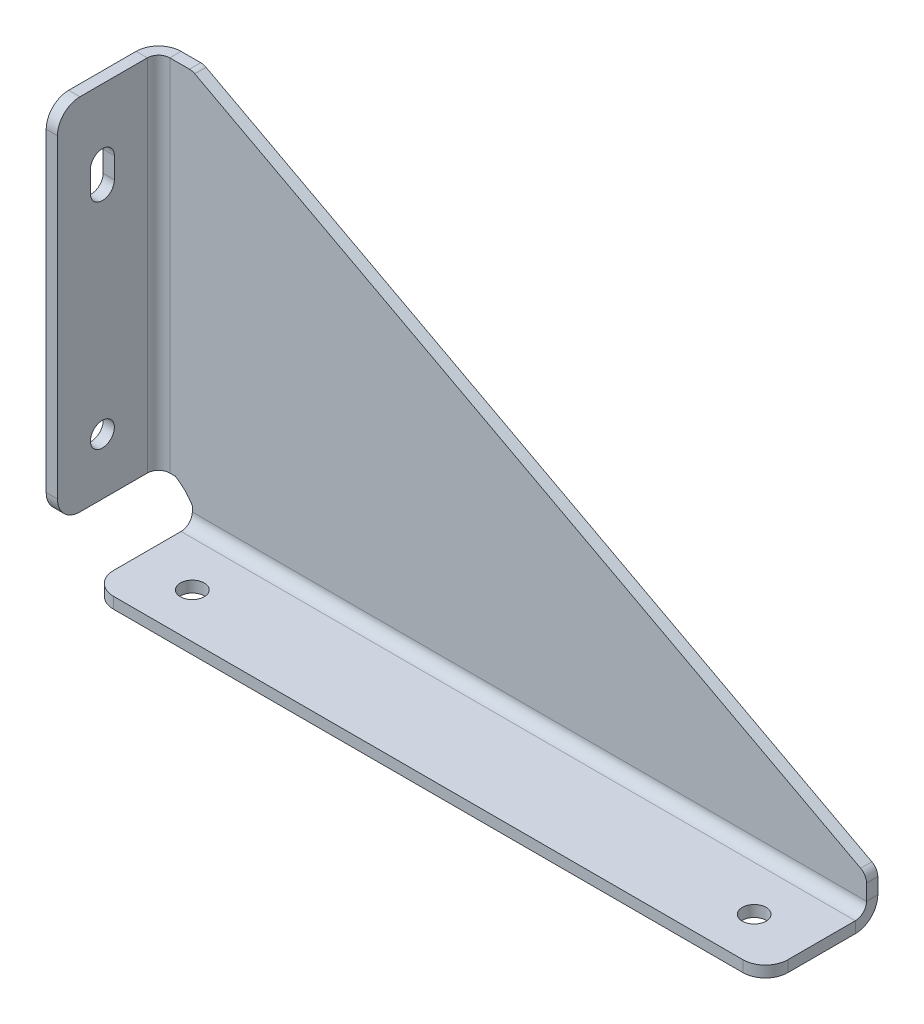
ISO-10303-21;
HEADER;
FILE_DESCRIPTION(('STEP AP214'),'2;1');
FILE_NAME('part.step','',(''),(''),'','','');
FILE_SCHEMA(('AUTOMOTIVE_DESIGN { 1 0 10303 214 1 1 1 1 }'));
ENDSEC;
DATA;
#1=APPLICATION_CONTEXT('core data for automotive mechanical design processes');
#2=APPLICATION_PROTOCOL_DEFINITION('international standard','automotive_design',2000,#1);
#3=PRODUCT_CONTEXT('',#1,'mechanical');
#4=PRODUCT('Part','Part','',(#3));
#5=PRODUCT_RELATED_PRODUCT_CATEGORY('part','',(#4));
#6=PRODUCT_DEFINITION_FORMATION('','',#4);
#7=PRODUCT_DEFINITION_CONTEXT('part definition',#1,'design');
#8=PRODUCT_DEFINITION('design','',#6,#7);
#9=PRODUCT_DEFINITION_SHAPE('','',#8);
#10=(LENGTH_UNIT() NAMED_UNIT(*) SI_UNIT(.MILLI.,.METRE.));
#11=(NAMED_UNIT(*) PLANE_ANGLE_UNIT() SI_UNIT($,.RADIAN.));
#12=(NAMED_UNIT(*) SI_UNIT($,.STERADIAN.) SOLID_ANGLE_UNIT());
#13=UNCERTAINTY_MEASURE_WITH_UNIT(LENGTH_MEASURE(1.E-05),#10,'distance_accuracy_value','');
#14=(GEOMETRIC_REPRESENTATION_CONTEXT(3) GLOBAL_UNCERTAINTY_ASSIGNED_CONTEXT((#13)) GLOBAL_UNIT_ASSIGNED_CONTEXT((#10,
#11,#12)) REPRESENTATION_CONTEXT('',''));
#15=CARTESIAN_POINT('',(0.,0.,0.));
#16=DIRECTION('',(0.,0.,1.));
#17=DIRECTION('',(1.,0.,0.));
#18=AXIS2_PLACEMENT_3D('',#15,#16,#17);
#19=CARTESIAN_POINT('',(3.175,0.,0.));
#20=DIRECTION('',(1.,0.,0.));
#21=DIRECTION('',(0.,0.,-1.));
#22=AXIS2_PLACEMENT_3D('',#19,#20,#21);
#23=PLANE('',#22);
#24=CARTESIAN_POINT('',(3.17499999999994,28.5749999999999,15.875));
#25=DIRECTION('',(1.,0.,0.));
#26=DIRECTION('',(0.,0.,-1.));
#27=AXIS2_PLACEMENT_3D('',#24,#25,#26);
#28=CIRCLE('',#27,3.3782);
#29=CARTESIAN_POINT('',(3.17499999999996,28.5749999999999,12.4968));
#30=VERTEX_POINT('',#29);
#31=EDGE_CURVE('E390',#30,#30,#28,.T.);
#32=ORIENTED_EDGE('',*,*,#31,.F.);
#33=EDGE_LOOP('',(#32));
#34=FACE_BOUND('',#33,.T.);
#35=DIRECTION('',(0.,-1.,0.));
#36=VECTOR('',#35,1.);
#37=CARTESIAN_POINT('',(3.1749999999999,0.,28.575));
#38=LINE('',#37,#36);
#39=CARTESIAN_POINT('',(3.1749999999999,107.95,28.575));
#40=VERTEX_POINT('',#39);
#41=CARTESIAN_POINT('',(3.1749999999999,19.05,28.575));
#42=VERTEX_POINT('',#41);
#43=EDGE_CURVE('E421',#40,#42,#38,.T.);
#44=ORIENTED_EDGE('',*,*,#43,.T.);
#45=CARTESIAN_POINT('',(3.17499999999992,19.05,22.225));
#46=DIRECTION('',(1.,0.,0.));
#47=DIRECTION('',(0.,0.,-1.));
#48=AXIS2_PLACEMENT_3D('',#45,#46,#47);
#49=CIRCLE('',#48,6.35);
#50=CARTESIAN_POINT('',(3.17499999999992,12.7,22.225));
#51=VERTEX_POINT('',#50);
#52=EDGE_CURVE('E603',#42,#51,#49,.T.);
#53=ORIENTED_EDGE('',*,*,#52,.T.);
#54=DIRECTION('',(0.,0.,-1.));
#55=VECTOR('',#54,1.);
#56=CARTESIAN_POINT('',(3.175,12.7,0.));
#57=LINE('',#56,#55);
#58=CARTESIAN_POINT('',(3.17499999999997,12.7,3.17499999999999));
#59=VERTEX_POINT('',#58);
#60=EDGE_CURVE('E419',#51,#59,#57,.T.);
#61=ORIENTED_EDGE('',*,*,#60,.T.);
#62=DIRECTION('',(0.,-1.,0.));
#63=VECTOR('',#62,1.);
#64=CARTESIAN_POINT('',(3.17499999999999,114.3,3.17499999999999));
#65=LINE('',#64,#63);
#66=CARTESIAN_POINT('',(3.17499999999999,114.3,3.17499999999999));
#67=VERTEX_POINT('',#66);
#68=EDGE_CURVE('E434',#67,#59,#65,.T.);
#69=ORIENTED_EDGE('',*,*,#68,.F.);
#70=DIRECTION('',(0.,0.,1.));
#71=VECTOR('',#70,1.);
#72=CARTESIAN_POINT('',(3.175,114.3,0.));
#73=LINE('',#72,#71);
#74=CARTESIAN_POINT('',(3.17499999999992,114.3,22.225));
#75=VERTEX_POINT('',#74);
#76=EDGE_CURVE('E424',#67,#75,#73,.T.);
#77=ORIENTED_EDGE('',*,*,#76,.T.);
#78=CARTESIAN_POINT('',(3.17499999999992,107.95,22.225));
#79=DIRECTION('',(1.,0.,0.));
#80=DIRECTION('',(0.,0.,-1.));
#81=AXIS2_PLACEMENT_3D('',#78,#79,#80);
#82=CIRCLE('',#81,6.35);
#83=EDGE_CURVE('E601',#75,#40,#82,.T.);
#84=ORIENTED_EDGE('',*,*,#83,.T.);
#85=EDGE_LOOP('',(#44,#53,#61,#69,#77,#84));
#86=FACE_BOUND('',#85,.T.);
#87=CARTESIAN_POINT('',(3.17500000000006,89.1032,15.875));
#88=DIRECTION('',(1.,0.,0.));
#89=DIRECTION('',(0.,0.,-1.));
#90=AXIS2_PLACEMENT_3D('',#87,#88,#89);
#91=CIRCLE('',#90,3.3782);
#92=CARTESIAN_POINT('',(3.17500000000007,89.1032,19.2532));
#93=VERTEX_POINT('',#92);
#94=CARTESIAN_POINT('',(3.17500000000004,89.1032,12.4968));
#95=VERTEX_POINT('',#94);
#96=EDGE_CURVE('E367',#93,#95,#91,.T.);
#97=ORIENTED_EDGE('',*,*,#96,.F.);
#98=DIRECTION('',(0.,1.,0.));
#99=VECTOR('',#98,1.);
#100=CARTESIAN_POINT('',(3.17500000000007,89.1032,19.2532));
#101=LINE('',#100,#99);
#102=CARTESIAN_POINT('',(3.17500000000007,95.0467999999999,19.2532));
#103=VERTEX_POINT('',#102);
#104=EDGE_CURVE('E176',#93,#103,#101,.T.);
#105=ORIENTED_EDGE('',*,*,#104,.T.);
#106=CARTESIAN_POINT('',(3.17500000000006,95.0467999999999,15.875));
#107=DIRECTION('',(1.,0.,0.));
#108=DIRECTION('',(0.,0.,-1.));
#109=AXIS2_PLACEMENT_3D('',#106,#107,#108);
#110=CIRCLE('',#109,3.3782);
#111=CARTESIAN_POINT('',(3.17500000000004,95.0467999999999,12.4968));
#112=VERTEX_POINT('',#111);
#113=EDGE_CURVE('E360',#112,#103,#110,.T.);
#114=ORIENTED_EDGE('',*,*,#113,.F.);
#115=DIRECTION('',(0.,1.,0.));
#116=VECTOR('',#115,1.);
#117=CARTESIAN_POINT('',(3.17499999999996,0.,12.4968));
#118=LINE('',#117,#116);
#119=EDGE_CURVE('E612',#95,#112,#118,.T.);
#120=ORIENTED_EDGE('',*,*,#119,.F.);
#121=EDGE_LOOP('',(#97,#105,#114,#120));
#122=FACE_BOUND('',#121,.T.);
#123=ADVANCED_FACE('F160',(#34,#86,#122),#23,.T.);
#124=CARTESIAN_POINT('',(0.,0.,-3.175));
#125=DIRECTION('',(0.,0.,-1.));
#126=DIRECTION('',(-1.,0.,0.));
#127=AXIS2_PLACEMENT_3D('',#124,#125,#126);
#128=PLANE('',#127);
#129=DIRECTION('',(-1.,0.,0.));
#130=VECTOR('',#129,1.);
#131=CARTESIAN_POINT('',(0.,114.3,-3.175));
#132=LINE('',#131,#130);
#133=CARTESIAN_POINT('',(11.90625,114.3,-3.175));
#134=VERTEX_POINT('',#133);
#135=CARTESIAN_POINT('',(6.35,114.3,-3.175));
#136=VERTEX_POINT('',#135);
#137=EDGE_CURVE('E537',#134,#136,#132,.T.);
#138=ORIENTED_EDGE('',*,*,#137,.F.);
#139=CARTESIAN_POINT('',(11.90625,111.125,-3.175));
#140=DIRECTION('',(0.,0.,-1.));
#141=DIRECTION('',(-1.,0.,0.));
#142=AXIS2_PLACEMENT_3D('',#139,#140,#141);
#143=CIRCLE('',#142,3.175);
#144=CARTESIAN_POINT('',(13.4003676470588,113.926470588235,-3.175));
#145=VERTEX_POINT('',#144);
#146=EDGE_CURVE('E572',#134,#145,#143,.T.);
#147=ORIENTED_EDGE('',*,*,#146,.T.);
#148=DIRECTION('',(-0.88235294117647,0.470588235294118,0.));
#149=VECTOR('',#148,1.);
#150=CARTESIAN_POINT('',(12.7,114.3,-3.175));
#151=LINE('',#150,#149);
#152=CARTESIAN_POINT('',(201.519117647059,13.5964705882353,-3.175));
#153=VERTEX_POINT('',#152);
#154=EDGE_CURVE('E544',#153,#145,#151,.T.);
#155=ORIENTED_EDGE('',*,*,#154,.F.);
#156=CARTESIAN_POINT('',(200.025,10.795,-3.175));
#157=DIRECTION('',(0.,0.,-1.));
#158=DIRECTION('',(-1.,0.,0.));
#159=AXIS2_PLACEMENT_3D('',#156,#157,#158);
#160=CIRCLE('',#159,3.175);
#161=CARTESIAN_POINT('',(203.2,10.795,-3.175));
#162=VERTEX_POINT('',#161);
#163=EDGE_CURVE('E570',#153,#162,#160,.T.);
#164=ORIENTED_EDGE('',*,*,#163,.T.);
#165=DIRECTION('',(0.,1.,0.));
#166=VECTOR('',#165,1.);
#167=CARTESIAN_POINT('',(203.2,12.7,-3.175));
#168=LINE('',#167,#166);
#169=CARTESIAN_POINT('',(203.2,6.35000000000002,-3.175));
#170=VERTEX_POINT('',#169);
#171=EDGE_CURVE('E540',#170,#162,#168,.T.);
#172=ORIENTED_EDGE('',*,*,#171,.F.);
#173=DIRECTION('',(1.,0.,0.));
#174=VECTOR('',#173,1.);
#175=CARTESIAN_POINT('',(203.2,6.35000000000002,-3.175));
#176=LINE('',#175,#174);
#177=CARTESIAN_POINT('',(12.7,6.34999999999997,-3.175));
#178=VERTEX_POINT('',#177);
#179=EDGE_CURVE('E497',#170,#178,#176,.F.);
#180=ORIENTED_EDGE('',*,*,#179,.T.);
#181=DIRECTION('',(0.,1.,0.));
#182=VECTOR('',#181,1.);
#183=CARTESIAN_POINT('',(12.7,0.,-3.175));
#184=LINE('',#183,#182);
#185=CARTESIAN_POINT('',(12.7,7.9375,-3.175));
#186=VERTEX_POINT('',#185);
#187=EDGE_CURVE('E531',#178,#186,#184,.T.);
#188=ORIENTED_EDGE('',*,*,#187,.T.);
#189=CARTESIAN_POINT('',(0.,0.,-3.175));
#190=DIRECTION('',(0.,0.,1.));
#191=DIRECTION('',(1.,0.,0.));
#192=AXIS2_PLACEMENT_3D('',#189,#190,#191);
#193=CIRCLE('',#192,14.9764450471398);
#194=CARTESIAN_POINT('',(7.93749999999999,12.7,-3.175));
#195=VERTEX_POINT('',#194);
#196=EDGE_CURVE('E387',#186,#195,#193,.T.);
#197=ORIENTED_EDGE('',*,*,#196,.T.);
#198=DIRECTION('',(-1.,0.,0.));
#199=VECTOR('',#198,1.);
#200=CARTESIAN_POINT('',(0.,12.7,-3.175));
#201=LINE('',#200,#199);
#202=CARTESIAN_POINT('',(6.35,12.7,-3.17500000000001));
#203=VERTEX_POINT('',#202);
#204=EDGE_CURVE('E523',#195,#203,#201,.T.);
#205=ORIENTED_EDGE('',*,*,#204,.T.);
#206=DIRECTION('',(0.,-1.,0.));
#207=VECTOR('',#206,1.);
#208=CARTESIAN_POINT('',(6.35,12.7,-3.17500000000001));
#209=LINE('',#208,#207);
#210=EDGE_CURVE('E441',#203,#136,#209,.F.);
#211=ORIENTED_EDGE('',*,*,#210,.T.);
#212=EDGE_LOOP('',(#138,#147,#155,#164,#172,#180,#188,#197,#205,#211));
#213=FACE_BOUND('',#212,.T.);
#214=ADVANCED_FACE('F631',(#213),#128,.T.);
#215=CARTESIAN_POINT('',(0.,0.,0.));
#216=DIRECTION('',(0.,0.,-1.));
#217=DIRECTION('',(-1.,0.,0.));
#218=AXIS2_PLACEMENT_3D('',#215,#216,#217);
#219=PLANE('',#218);
#220=DIRECTION('',(-0.88235294117647,0.470588235294118,0.));
#221=VECTOR('',#220,1.);
#222=CARTESIAN_POINT('',(12.7,114.3,0.));
#223=LINE('',#222,#221);
#224=CARTESIAN_POINT('',(201.519117647059,13.5964705882353,0.));
#225=VERTEX_POINT('',#224);
#226=CARTESIAN_POINT('',(13.4003676470588,113.926470588235,0.));
#227=VERTEX_POINT('',#226);
#228=EDGE_CURVE('E541',#225,#227,#223,.T.);
#229=ORIENTED_EDGE('',*,*,#228,.T.);
#230=CARTESIAN_POINT('',(11.90625,111.125,0.));
#231=DIRECTION('',(0.,0.,-1.));
#232=DIRECTION('',(-1.,0.,0.));
#233=AXIS2_PLACEMENT_3D('',#230,#231,#232);
#234=CIRCLE('',#233,3.175);
#235=CARTESIAN_POINT('',(11.90625,114.3,0.));
#236=VERTEX_POINT('',#235);
#237=EDGE_CURVE('E564',#227,#236,#234,.F.);
#238=ORIENTED_EDGE('',*,*,#237,.T.);
#239=DIRECTION('',(-1.,0.,0.));
#240=VECTOR('',#239,1.);
#241=CARTESIAN_POINT('',(0.,114.3,0.));
#242=LINE('',#241,#240);
#243=CARTESIAN_POINT('',(6.35,114.3,0.));
#244=VERTEX_POINT('',#243);
#245=EDGE_CURVE('E536',#236,#244,#242,.T.);
#246=ORIENTED_EDGE('',*,*,#245,.T.);
#247=DIRECTION('',(0.,-1.,0.));
#248=VECTOR('',#247,1.);
#249=CARTESIAN_POINT('',(6.34999999999999,12.7,0.));
#250=LINE('',#249,#248);
#251=CARTESIAN_POINT('',(6.34999999999999,12.7,0.));
#252=VERTEX_POINT('',#251);
#253=EDGE_CURVE('E457',#252,#244,#250,.F.);
#254=ORIENTED_EDGE('',*,*,#253,.F.);
#255=DIRECTION('',(-1.,0.,0.));
#256=VECTOR('',#255,1.);
#257=CARTESIAN_POINT('',(7.93749999999999,12.7,0.));
#258=LINE('',#257,#256);
#259=CARTESIAN_POINT('',(7.93749999999999,12.7,0.));
#260=VERTEX_POINT('',#259);
#261=EDGE_CURVE('E520',#260,#252,#258,.T.);
#262=ORIENTED_EDGE('',*,*,#261,.F.);
#263=CARTESIAN_POINT('',(0.,0.,0.));
#264=DIRECTION('',(0.,0.,1.));
#265=DIRECTION('',(-1.,0.,0.));
#266=AXIS2_PLACEMENT_3D('',#263,#264,#265);
#267=CIRCLE('',#266,14.9764450471398);
#268=CARTESIAN_POINT('',(12.7,7.9375,0.));
#269=VERTEX_POINT('',#268);
#270=EDGE_CURVE('E386',#269,#260,#267,.T.);
#271=ORIENTED_EDGE('',*,*,#270,.F.);
#272=DIRECTION('',(0.,1.,0.));
#273=VECTOR('',#272,1.);
#274=CARTESIAN_POINT('',(12.7,6.34999999999997,0.));
#275=LINE('',#274,#273);
#276=CARTESIAN_POINT('',(12.7,6.34999999999997,0.));
#277=VERTEX_POINT('',#276);
#278=EDGE_CURVE('E528',#277,#269,#275,.T.);
#279=ORIENTED_EDGE('',*,*,#278,.F.);
#280=DIRECTION('',(1.,0.,0.));
#281=VECTOR('',#280,1.);
#282=CARTESIAN_POINT('',(203.2,6.35000000000003,0.));
#283=LINE('',#282,#281);
#284=CARTESIAN_POINT('',(203.2,6.35000000000003,0.));
#285=VERTEX_POINT('',#284);
#286=EDGE_CURVE('E510',#285,#277,#283,.F.);
#287=ORIENTED_EDGE('',*,*,#286,.F.);
#288=DIRECTION('',(0.,1.,0.));
#289=VECTOR('',#288,1.);
#290=CARTESIAN_POINT('',(203.2,12.7,0.));
#291=LINE('',#290,#289);
#292=CARTESIAN_POINT('',(203.2,10.795,0.));
#293=VERTEX_POINT('',#292);
#294=EDGE_CURVE('E551',#285,#293,#291,.T.);
#295=ORIENTED_EDGE('',*,*,#294,.T.);
#296=CARTESIAN_POINT('',(200.025,10.795,0.));
#297=DIRECTION('',(0.,0.,-1.));
#298=DIRECTION('',(-1.,0.,0.));
#299=AXIS2_PLACEMENT_3D('',#296,#297,#298);
#300=CIRCLE('',#299,3.175);
#301=EDGE_CURVE('E562',#293,#225,#300,.F.);
#302=ORIENTED_EDGE('',*,*,#301,.T.);
#303=EDGE_LOOP('',(#229,#238,#246,#254,#262,#271,#279,#287,#295,#302));
#304=FACE_BOUND('',#303,.T.);
#305=ADVANCED_FACE('F637',(#304),#219,.F.);
#306=CARTESIAN_POINT('',(203.2,12.7,-3.175));
#307=DIRECTION('',(1.,0.,0.));
#308=DIRECTION('',(0.,1.,0.));
#309=AXIS2_PLACEMENT_3D('',#306,#307,#308);
#310=PLANE('',#309);
#311=ORIENTED_EDGE('',*,*,#171,.T.);
#312=DIRECTION('',(0.,0.,1.));
#313=VECTOR('',#312,1.);
#314=CARTESIAN_POINT('',(203.2,10.795,-3.175));
#315=LINE('',#314,#313);
#316=EDGE_CURVE('E575',#162,#293,#315,.T.);
#317=ORIENTED_EDGE('',*,*,#316,.T.);
#318=ORIENTED_EDGE('',*,*,#294,.F.);
#319=DIRECTION('',(0.,0.,-1.));
#320=VECTOR('',#319,1.);
#321=CARTESIAN_POINT('',(203.2,6.35000000000003,0.));
#322=LINE('',#321,#320);
#323=EDGE_CURVE('E504',#285,#170,#322,.T.);
#324=ORIENTED_EDGE('',*,*,#323,.T.);
#325=EDGE_LOOP('',(#311,#317,#318,#324));
#326=FACE_BOUND('',#325,.T.);
#327=ADVANCED_FACE('F721',(#326),#310,.T.);
#328=CARTESIAN_POINT('',(0.,114.3,-3.175));
#329=DIRECTION('',(0.,1.,0.));
#330=DIRECTION('',(0.,0.,1.));
#331=AXIS2_PLACEMENT_3D('',#328,#329,#330);
#332=PLANE('',#331);
#333=ORIENTED_EDGE('',*,*,#245,.F.);
#334=DIRECTION('',(0.,0.,1.));
#335=VECTOR('',#334,1.);
#336=CARTESIAN_POINT('',(11.90625,114.3,-3.175));
#337=LINE('',#336,#335);
#338=EDGE_CURVE('E567',#236,#134,#337,.F.);
#339=ORIENTED_EDGE('',*,*,#338,.T.);
#340=ORIENTED_EDGE('',*,*,#137,.T.);
#341=DIRECTION('',(0.,0.,-1.));
#342=VECTOR('',#341,1.);
#343=CARTESIAN_POINT('',(6.35,114.3,0.));
#344=LINE('',#343,#342);
#345=EDGE_CURVE('E463',#244,#136,#344,.T.);
#346=ORIENTED_EDGE('',*,*,#345,.F.);
#347=EDGE_LOOP('',(#333,#339,#340,#346));
#348=FACE_BOUND('',#347,.T.);
#349=ADVANCED_FACE('F725',(#348),#332,.T.);
#350=CARTESIAN_POINT('',(12.7,114.3,-3.175));
#351=DIRECTION('',(0.470588235294118,0.882352941176471,0.));
#352=DIRECTION('',(-0.882352941176471,0.470588235294118,0.));
#353=AXIS2_PLACEMENT_3D('',#350,#351,#352);
#354=PLANE('',#353);
#355=ORIENTED_EDGE('',*,*,#154,.T.);
#356=DIRECTION('',(0.,0.,1.));
#357=VECTOR('',#356,1.);
#358=CARTESIAN_POINT('',(13.4003676470588,113.926470588235,-3.175));
#359=LINE('',#358,#357);
#360=EDGE_CURVE('E558',#145,#227,#359,.T.);
#361=ORIENTED_EDGE('',*,*,#360,.T.);
#362=ORIENTED_EDGE('',*,*,#228,.F.);
#363=DIRECTION('',(0.,0.,1.));
#364=VECTOR('',#363,1.);
#365=CARTESIAN_POINT('',(201.519117647059,13.5964705882353,-3.175));
#366=LINE('',#365,#364);
#367=EDGE_CURVE('E548',#225,#153,#366,.F.);
#368=ORIENTED_EDGE('',*,*,#367,.T.);
#369=EDGE_LOOP('',(#355,#361,#362,#368));
#370=FACE_BOUND('',#369,.T.);
#371=ADVANCED_FACE('F716',(#370),#354,.T.);
#372=CARTESIAN_POINT('',(12.7,6.34999999999997,0.));
#373=DIRECTION('',(-1.,0.,0.));
#374=DIRECTION('',(0.,0.,1.));
#375=AXIS2_PLACEMENT_3D('',#372,#373,#374);
#376=PLANE('',#375);
#377=ORIENTED_EDGE('',*,*,#187,.F.);
#378=DIRECTION('',(0.,0.,-1.));
#379=VECTOR('',#378,1.);
#380=CARTESIAN_POINT('',(12.7,6.34999999999997,0.));
#381=LINE('',#380,#379);
#382=EDGE_CURVE('E514',#277,#178,#381,.T.);
#383=ORIENTED_EDGE('',*,*,#382,.F.);
#384=ORIENTED_EDGE('',*,*,#278,.T.);
#385=DIRECTION('',(0.,0.,-1.));
#386=VECTOR('',#385,1.);
#387=CARTESIAN_POINT('',(12.7,7.93749999999997,0.));
#388=LINE('',#387,#386);
#389=EDGE_CURVE('E527',#269,#186,#388,.T.);
#390=ORIENTED_EDGE('',*,*,#389,.T.);
#391=EDGE_LOOP('',(#377,#383,#384,#390));
#392=FACE_BOUND('',#391,.T.);
#393=ADVANCED_FACE('F713',(#392),#376,.T.);
#394=CARTESIAN_POINT('',(7.93749999999999,12.7,0.));
#395=DIRECTION('',(0.,-1.,0.));
#396=DIRECTION('',(0.,0.,-1.));
#397=AXIS2_PLACEMENT_3D('',#394,#395,#396);
#398=PLANE('',#397);
#399=ORIENTED_EDGE('',*,*,#204,.F.);
#400=DIRECTION('',(0.,0.,-1.));
#401=VECTOR('',#400,1.);
#402=CARTESIAN_POINT('',(7.93749999999999,12.7,0.));
#403=LINE('',#402,#401);
#404=EDGE_CURVE('E517',#260,#195,#403,.T.);
#405=ORIENTED_EDGE('',*,*,#404,.F.);
#406=ORIENTED_EDGE('',*,*,#261,.T.);
#407=DIRECTION('',(0.,0.,-1.));
#408=VECTOR('',#407,1.);
#409=CARTESIAN_POINT('',(6.34999999999999,12.7,0.));
#410=LINE('',#409,#408);
#411=EDGE_CURVE('E450',#252,#203,#410,.T.);
#412=ORIENTED_EDGE('',*,*,#411,.T.);
#413=EDGE_LOOP('',(#399,#405,#406,#412));
#414=FACE_BOUND('',#413,.T.);
#415=ADVANCED_FACE('F706',(#414),#398,.T.);
#416=CARTESIAN_POINT('',(12.7,6.34999999999998,3.175));
#417=DIRECTION('',(-1.,0.,0.));
#418=DIRECTION('',(0.,-1.,0.));
#419=AXIS2_PLACEMENT_3D('',#416,#417,#418);
#420=PLANE('',#419);
#421=DIRECTION('',(0.,-1.,0.));
#422=VECTOR('',#421,1.);
#423=CARTESIAN_POINT('',(12.7,0.,3.17499999999998));
#424=LINE('',#423,#422);
#425=CARTESIAN_POINT('',(12.7,3.17499999999999,3.17499999999999));
#426=VERTEX_POINT('',#425);
#427=CARTESIAN_POINT('',(12.7,0.,3.17499999999998));
#428=VERTEX_POINT('',#427);
#429=EDGE_CURVE('E467',#426,#428,#424,.T.);
#430=ORIENTED_EDGE('',*,*,#429,.F.);
#431=CARTESIAN_POINT('',(12.7,6.34999999999998,3.175));
#432=DIRECTION('',(1.,0.,0.));
#433=DIRECTION('',(0.,1.,0.));
#434=AXIS2_PLACEMENT_3D('',#431,#432,#433);
#435=CIRCLE('',#434,3.17499999999999);
#436=EDGE_CURVE('E507',#277,#426,#435,.F.);
#437=ORIENTED_EDGE('',*,*,#436,.F.);
#438=ORIENTED_EDGE('',*,*,#382,.T.);
#439=CARTESIAN_POINT('',(12.7,6.34999999999998,3.175));
#440=DIRECTION('',(1.,0.,0.));
#441=DIRECTION('',(0.,1.,0.));
#442=AXIS2_PLACEMENT_3D('',#439,#440,#441);
#443=CIRCLE('',#442,6.34999999999999);
#444=EDGE_CURVE('E500',#178,#428,#443,.F.);
#445=ORIENTED_EDGE('',*,*,#444,.T.);
#446=EDGE_LOOP('',(#430,#437,#438,#445));
#447=FACE_BOUND('',#446,.T.);
#448=ADVANCED_FACE('F703',(#447),#420,.T.);
#449=CARTESIAN_POINT('',(203.2,6.35000000000003,3.17499999999999));
#450=DIRECTION('',(-1.,0.,0.));
#451=DIRECTION('',(0.,-1.,0.));
#452=AXIS2_PLACEMENT_3D('',#449,#450,#451);
#453=PLANE('',#452);
#454=CARTESIAN_POINT('',(203.2,6.35000000000003,3.17499999999999));
#455=DIRECTION('',(1.,0.,0.));
#456=DIRECTION('',(0.,1.,0.));
#457=AXIS2_PLACEMENT_3D('',#454,#455,#456);
#458=CIRCLE('',#457,3.17499999999999);
#459=CARTESIAN_POINT('',(203.2,3.17500000000004,3.17499999999998));
#460=VERTEX_POINT('',#459);
#461=EDGE_CURVE('E472',#460,#285,#458,.T.);
#462=ORIENTED_EDGE('',*,*,#461,.F.);
#463=DIRECTION('',(0.,-1.,0.));
#464=VECTOR('',#463,1.);
#465=CARTESIAN_POINT('',(203.2,3.17500000000002,3.17499999999998));
#466=LINE('',#465,#464);
#467=CARTESIAN_POINT('',(203.2,0.,3.17499999999997));
#468=VERTEX_POINT('',#467);
#469=EDGE_CURVE('E489',#460,#468,#466,.T.);
#470=ORIENTED_EDGE('',*,*,#469,.T.);
#471=CARTESIAN_POINT('',(203.2,6.35000000000003,3.17499999999999));
#472=DIRECTION('',(1.,0.,0.));
#473=DIRECTION('',(0.,1.,0.));
#474=AXIS2_PLACEMENT_3D('',#471,#472,#473);
#475=CIRCLE('',#474,6.34999999999999);
#476=EDGE_CURVE('E501',#468,#170,#475,.T.);
#477=ORIENTED_EDGE('',*,*,#476,.T.);
#478=ORIENTED_EDGE('',*,*,#323,.F.);
#479=EDGE_LOOP('',(#462,#470,#477,#478));
#480=FACE_BOUND('',#479,.T.);
#481=ADVANCED_FACE('F698',(#480),#453,.F.);
#482=CARTESIAN_POINT('',(203.2,6.35000000000003,3.17499999999999));
#483=DIRECTION('',(1.,0.,0.));
#484=DIRECTION('',(0.,-1.,0.));
#485=AXIS2_PLACEMENT_3D('',#482,#483,#484);
#486=CYLINDRICAL_SURFACE('',#485,6.34999999999999);
#487=ORIENTED_EDGE('',*,*,#179,.F.);
#488=ORIENTED_EDGE('',*,*,#476,.F.);
#489=DIRECTION('',(1.,0.,0.));
#490=VECTOR('',#489,1.);
#491=CARTESIAN_POINT('',(12.7,0.,3.17499999999998));
#492=LINE('',#491,#490);
#493=EDGE_CURVE('E487',#468,#428,#492,.F.);
#494=ORIENTED_EDGE('',*,*,#493,.T.);
#495=ORIENTED_EDGE('',*,*,#444,.F.);
#496=EDGE_LOOP('',(#487,#488,#494,#495));
#497=FACE_BOUND('',#496,.T.);
#498=ADVANCED_FACE('F695',(#497),#486,.T.);
#499=CARTESIAN_POINT('',(203.2,6.35000000000003,3.17499999999999));
#500=DIRECTION('',(1.,0.,0.));
#501=DIRECTION('',(0.,-1.,0.));
#502=AXIS2_PLACEMENT_3D('',#499,#500,#501);
#503=CYLINDRICAL_SURFACE('',#502,3.17499999999999);
#504=ORIENTED_EDGE('',*,*,#286,.T.);
#505=ORIENTED_EDGE('',*,*,#436,.T.);
#506=DIRECTION('',(1.,0.,0.));
#507=VECTOR('',#506,1.);
#508=CARTESIAN_POINT('',(12.7,3.17499999999999,3.17499999999999));
#509=LINE('',#508,#507);
#510=EDGE_CURVE('E492',#426,#460,#509,.T.);
#511=ORIENTED_EDGE('',*,*,#510,.T.);
#512=ORIENTED_EDGE('',*,*,#461,.T.);
#513=EDGE_LOOP('',(#504,#505,#511,#512));
#514=FACE_BOUND('',#513,.T.);
#515=ADVANCED_FACE('F693',(#514),#503,.F.);
#516=CARTESIAN_POINT('',(12.7,0.,0.));
#517=DIRECTION('',(-1.,0.,0.));
#518=DIRECTION('',(0.,-1.,0.));
#519=AXIS2_PLACEMENT_3D('',#516,#517,#518);
#520=PLANE('',#519);
#521=DIRECTION('',(0.,0.,-1.));
#522=VECTOR('',#521,1.);
#523=CARTESIAN_POINT('',(12.7,0.,0.));
#524=LINE('',#523,#522);
#525=CARTESIAN_POINT('',(12.7,0.,22.225));
#526=VERTEX_POINT('',#525);
#527=EDGE_CURVE('E476',#428,#526,#524,.F.);
#528=ORIENTED_EDGE('',*,*,#527,.T.);
#529=DIRECTION('',(0.,1.,0.));
#530=VECTOR('',#529,1.);
#531=CARTESIAN_POINT('',(12.7,0.,22.225));
#532=LINE('',#531,#530);
#533=CARTESIAN_POINT('',(12.7,3.17499999999992,22.225));
#534=VERTEX_POINT('',#533);
#535=EDGE_CURVE('E593',#526,#534,#532,.T.);
#536=ORIENTED_EDGE('',*,*,#535,.T.);
#537=DIRECTION('',(0.,0.,1.));
#538=VECTOR('',#537,1.);
#539=CARTESIAN_POINT('',(12.7,3.175,0.));
#540=LINE('',#539,#538);
#541=EDGE_CURVE('E484',#426,#534,#540,.T.);
#542=ORIENTED_EDGE('',*,*,#541,.F.);
#543=ORIENTED_EDGE('',*,*,#429,.T.);
#544=EDGE_LOOP('',(#528,#536,#542,#543));
#545=FACE_BOUND('',#544,.T.);
#546=ADVANCED_FACE('F686',(#545),#520,.T.);
#547=CARTESIAN_POINT('',(203.2,0.,28.575));
#548=DIRECTION('',(1.,0.,0.));
#549=DIRECTION('',(0.,1.,0.));
#550=AXIS2_PLACEMENT_3D('',#547,#548,#549);
#551=PLANE('',#550);
#552=DIRECTION('',(0.,0.,-1.));
#553=VECTOR('',#552,1.);
#554=CARTESIAN_POINT('',(203.2,3.17500000000004,0.));
#555=LINE('',#554,#553);
#556=CARTESIAN_POINT('',(203.2,3.17499999999996,22.225));
#557=VERTEX_POINT('',#556);
#558=EDGE_CURVE('E479',#557,#460,#555,.T.);
#559=ORIENTED_EDGE('',*,*,#558,.F.);
#560=DIRECTION('',(0.,1.,0.));
#561=VECTOR('',#560,1.);
#562=CARTESIAN_POINT('',(203.2,0.,22.225));
#563=LINE('',#562,#561);
#564=CARTESIAN_POINT('',(203.2,0.,22.225));
#565=VERTEX_POINT('',#564);
#566=EDGE_CURVE('E587',#557,#565,#563,.F.);
#567=ORIENTED_EDGE('',*,*,#566,.T.);
#568=DIRECTION('',(0.,0.,1.));
#569=VECTOR('',#568,1.);
#570=CARTESIAN_POINT('',(203.2,0.,28.575));
#571=LINE('',#570,#569);
#572=EDGE_CURVE('E470',#565,#468,#571,.F.);
#573=ORIENTED_EDGE('',*,*,#572,.T.);
#574=ORIENTED_EDGE('',*,*,#469,.F.);
#575=EDGE_LOOP('',(#559,#567,#573,#574));
#576=FACE_BOUND('',#575,.T.);
#577=ADVANCED_FACE('F679',(#576),#551,.T.);
#578=CARTESIAN_POINT('',(0.,0.,0.));
#579=DIRECTION('',(0.,1.,0.));
#580=DIRECTION('',(0.,0.,1.));
#581=AXIS2_PLACEMENT_3D('',#578,#579,#580);
#582=PLANE('',#581);
#583=CARTESIAN_POINT('',(28.5749999999999,-1.40946282423116E-13,15.875));
#584=DIRECTION('',(0.,1.,0.));
#585=DIRECTION('',(0.,0.,1.));
#586=AXIS2_PLACEMENT_3D('',#583,#584,#585);
#587=CIRCLE('',#586,3.3782);
#588=CARTESIAN_POINT('',(28.5749999999999,-1.52741204681995E-13,19.2532));
#589=VERTEX_POINT('',#588);
#590=EDGE_CURVE('E400',#589,#589,#587,.T.);
#591=ORIENTED_EDGE('',*,*,#590,.T.);
#592=EDGE_LOOP('',(#591));
#593=FACE_BOUND('',#592,.T.);
#594=CARTESIAN_POINT('',(187.325,-1.40512601554121E-13,15.875));
#595=DIRECTION('',(0.,1.,0.));
#596=DIRECTION('',(0.,0.,1.));
#597=AXIS2_PLACEMENT_3D('',#594,#595,#596);
#598=CIRCLE('',#597,3.3782);
#599=CARTESIAN_POINT('',(187.325,-1.52307523813001E-13,19.2532));
#600=VERTEX_POINT('',#599);
#601=EDGE_CURVE('E406',#600,#600,#598,.T.);
#602=ORIENTED_EDGE('',*,*,#601,.T.);
#603=EDGE_LOOP('',(#602));
#604=FACE_BOUND('',#603,.T.);
#605=ORIENTED_EDGE('',*,*,#572,.F.);
#606=CARTESIAN_POINT('',(196.85,0.,22.225));
#607=DIRECTION('',(0.,1.,0.));
#608=DIRECTION('',(0.,0.,1.));
#609=AXIS2_PLACEMENT_3D('',#606,#607,#608);
#610=CIRCLE('',#609,6.35);
#611=CARTESIAN_POINT('',(196.85,0.,28.575));
#612=VERTEX_POINT('',#611);
#613=EDGE_CURVE('E591',#565,#612,#610,.F.);
#614=ORIENTED_EDGE('',*,*,#613,.T.);
#615=DIRECTION('',(-1.,0.,0.));
#616=VECTOR('',#615,1.);
#617=CARTESIAN_POINT('',(12.7,0.,28.575));
#618=LINE('',#617,#616);
#619=CARTESIAN_POINT('',(19.05,0.,28.575));
#620=VERTEX_POINT('',#619);
#621=EDGE_CURVE('E473',#620,#612,#618,.F.);
#622=ORIENTED_EDGE('',*,*,#621,.F.);
#623=CARTESIAN_POINT('',(19.05,0.,22.225));
#624=DIRECTION('',(0.,1.,0.));
#625=DIRECTION('',(0.,0.,1.));
#626=AXIS2_PLACEMENT_3D('',#623,#624,#625);
#627=CIRCLE('',#626,6.35);
#628=EDGE_CURVE('E589',#620,#526,#627,.F.);
#629=ORIENTED_EDGE('',*,*,#628,.T.);
#630=ORIENTED_EDGE('',*,*,#527,.F.);
#631=ORIENTED_EDGE('',*,*,#493,.F.);
#632=EDGE_LOOP('',(#605,#614,#622,#629,#630,#631));
#633=FACE_BOUND('',#632,.T.);
#634=ADVANCED_FACE('F675',(#593,#604,#633),#582,.F.);
#635=CARTESIAN_POINT('',(0.,3.175,0.));
#636=DIRECTION('',(0.,1.,0.));
#637=DIRECTION('',(0.,0.,1.));
#638=AXIS2_PLACEMENT_3D('',#635,#636,#637);
#639=PLANE('',#638);
#640=CARTESIAN_POINT('',(28.5749999999999,3.17499999999997,15.875));
#641=DIRECTION('',(0.,1.,0.));
#642=DIRECTION('',(0.,0.,1.));
#643=AXIS2_PLACEMENT_3D('',#640,#641,#642);
#644=CIRCLE('',#643,3.3782);
#645=CARTESIAN_POINT('',(28.5749999999999,3.17499999999996,19.2532));
#646=VERTEX_POINT('',#645);
#647=EDGE_CURVE('E397',#646,#646,#644,.T.);
#648=ORIENTED_EDGE('',*,*,#647,.F.);
#649=EDGE_LOOP('',(#648));
#650=FACE_BOUND('',#649,.T.);
#651=CARTESIAN_POINT('',(187.325,3.17499999999997,15.875));
#652=DIRECTION('',(0.,1.,0.));
#653=DIRECTION('',(0.,0.,1.));
#654=AXIS2_PLACEMENT_3D('',#651,#652,#653);
#655=CIRCLE('',#654,3.3782);
#656=CARTESIAN_POINT('',(187.325,3.17499999999996,19.2532));
#657=VERTEX_POINT('',#656);
#658=EDGE_CURVE('E403',#657,#657,#655,.T.);
#659=ORIENTED_EDGE('',*,*,#658,.F.);
#660=EDGE_LOOP('',(#659));
#661=FACE_BOUND('',#660,.T.);
#662=DIRECTION('',(1.,0.,0.));
#663=VECTOR('',#662,1.);
#664=CARTESIAN_POINT('',(0.,3.1749999999999,28.575));
#665=LINE('',#664,#663);
#666=CARTESIAN_POINT('',(19.05,3.1749999999999,28.575));
#667=VERTEX_POINT('',#666);
#668=CARTESIAN_POINT('',(196.85,3.17499999999993,28.575));
#669=VERTEX_POINT('',#668);
#670=EDGE_CURVE('E481',#667,#669,#665,.T.);
#671=ORIENTED_EDGE('',*,*,#670,.T.);
#672=CARTESIAN_POINT('',(196.85,3.17499999999996,22.225));
#673=DIRECTION('',(0.,1.,0.));
#674=DIRECTION('',(0.,0.,1.));
#675=AXIS2_PLACEMENT_3D('',#672,#673,#674);
#676=CIRCLE('',#675,6.35);
#677=EDGE_CURVE('E585',#669,#557,#676,.T.);
#678=ORIENTED_EDGE('',*,*,#677,.T.);
#679=ORIENTED_EDGE('',*,*,#558,.T.);
#680=ORIENTED_EDGE('',*,*,#510,.F.);
#681=ORIENTED_EDGE('',*,*,#541,.T.);
#682=CARTESIAN_POINT('',(19.05,3.17499999999993,22.225));
#683=DIRECTION('',(0.,1.,0.));
#684=DIRECTION('',(0.,0.,1.));
#685=AXIS2_PLACEMENT_3D('',#682,#683,#684);
#686=CIRCLE('',#685,6.35);
#687=EDGE_CURVE('E583',#534,#667,#686,.T.);
#688=ORIENTED_EDGE('',*,*,#687,.T.);
#689=EDGE_LOOP('',(#671,#678,#679,#680,#681,#688));
#690=FACE_BOUND('',#689,.T.);
#691=ADVANCED_FACE('F678',(#650,#661,#690),#639,.T.);
#692=CARTESIAN_POINT('',(12.7,0.,28.575));
#693=DIRECTION('',(0.,0.,1.));
#694=DIRECTION('',(0.,-1.,0.));
#695=AXIS2_PLACEMENT_3D('',#692,#693,#694);
#696=PLANE('',#695);
#697=ORIENTED_EDGE('',*,*,#621,.T.);
#698=DIRECTION('',(0.,1.,0.));
#699=VECTOR('',#698,1.);
#700=CARTESIAN_POINT('',(196.85,0.,28.575));
#701=LINE('',#700,#699);
#702=EDGE_CURVE('E580',#612,#669,#701,.T.);
#703=ORIENTED_EDGE('',*,*,#702,.T.);
#704=ORIENTED_EDGE('',*,*,#670,.F.);
#705=DIRECTION('',(0.,1.,0.));
#706=VECTOR('',#705,1.);
#707=CARTESIAN_POINT('',(19.05,0.,28.575));
#708=LINE('',#707,#706);
#709=EDGE_CURVE('E578',#667,#620,#708,.F.);
#710=ORIENTED_EDGE('',*,*,#709,.T.);
#711=EDGE_LOOP('',(#697,#703,#704,#710));
#712=FACE_BOUND('',#711,.T.);
#713=ADVANCED_FACE('F670',(#712),#696,.T.);
#714=CARTESIAN_POINT('',(6.34999999999999,114.3,3.175));
#715=DIRECTION('',(0.,1.,0.));
#716=DIRECTION('',(-1.,0.,0.));
#717=AXIS2_PLACEMENT_3D('',#714,#715,#716);
#718=PLANE('',#717);
#719=DIRECTION('',(-1.,0.,0.));
#720=VECTOR('',#719,1.);
#721=CARTESIAN_POINT('',(0.,114.3,3.17499999999998));
#722=LINE('',#721,#720);
#723=CARTESIAN_POINT('',(0.,114.3,3.17499999999998));
#724=VERTEX_POINT('',#723);
#725=EDGE_CURVE('E409',#67,#724,#722,.T.);
#726=ORIENTED_EDGE('',*,*,#725,.F.);
#727=CARTESIAN_POINT('',(6.34999999999999,114.3,3.175));
#728=DIRECTION('',(0.,-1.,0.));
#729=DIRECTION('',(1.,0.,0.));
#730=AXIS2_PLACEMENT_3D('',#727,#728,#729);
#731=CIRCLE('',#730,3.17500000000001);
#732=EDGE_CURVE('E453',#244,#67,#731,.F.);
#733=ORIENTED_EDGE('',*,*,#732,.F.);
#734=ORIENTED_EDGE('',*,*,#345,.T.);
#735=CARTESIAN_POINT('',(6.34999999999999,114.3,3.175));
#736=DIRECTION('',(0.,-1.,0.));
#737=DIRECTION('',(1.,0.,0.));
#738=AXIS2_PLACEMENT_3D('',#735,#736,#737);
#739=CIRCLE('',#738,6.35000000000001);
#740=EDGE_CURVE('E445',#136,#724,#739,.F.);
#741=ORIENTED_EDGE('',*,*,#740,.T.);
#742=EDGE_LOOP('',(#726,#733,#734,#741));
#743=FACE_BOUND('',#742,.T.);
#744=ADVANCED_FACE('F667',(#743),#718,.T.);
#745=CARTESIAN_POINT('',(6.34999999999998,12.7,3.175));
#746=DIRECTION('',(0.,1.,0.));
#747=DIRECTION('',(-1.,0.,0.));
#748=AXIS2_PLACEMENT_3D('',#745,#746,#747);
#749=PLANE('',#748);
#750=CARTESIAN_POINT('',(6.34999999999998,12.7,3.175));
#751=DIRECTION('',(0.,-1.,0.));
#752=DIRECTION('',(1.,0.,0.));
#753=AXIS2_PLACEMENT_3D('',#750,#751,#752);
#754=CIRCLE('',#753,3.17500000000001);
#755=EDGE_CURVE('E412',#59,#252,#754,.T.);
#756=ORIENTED_EDGE('',*,*,#755,.F.);
#757=DIRECTION('',(-1.,0.,0.));
#758=VECTOR('',#757,1.);
#759=CARTESIAN_POINT('',(3.17499999999999,12.7,3.17499999999999));
#760=LINE('',#759,#758);
#761=CARTESIAN_POINT('',(0.,12.7,3.17499999999998));
#762=VERTEX_POINT('',#761);
#763=EDGE_CURVE('E431',#59,#762,#760,.T.);
#764=ORIENTED_EDGE('',*,*,#763,.T.);
#765=CARTESIAN_POINT('',(6.34999999999998,12.7,3.175));
#766=DIRECTION('',(0.,-1.,0.));
#767=DIRECTION('',(1.,0.,0.));
#768=AXIS2_PLACEMENT_3D('',#765,#766,#767);
#769=CIRCLE('',#768,6.35000000000001);
#770=EDGE_CURVE('E446',#762,#203,#769,.T.);
#771=ORIENTED_EDGE('',*,*,#770,.T.);
#772=ORIENTED_EDGE('',*,*,#411,.F.);
#773=EDGE_LOOP('',(#756,#764,#771,#772));
#774=FACE_BOUND('',#773,.T.);
#775=ADVANCED_FACE('F662',(#774),#749,.F.);
#776=CARTESIAN_POINT('',(6.34999999999998,12.7,3.175));
#777=DIRECTION('',(0.,-1.,0.));
#778=DIRECTION('',(-1.,0.,0.));
#779=AXIS2_PLACEMENT_3D('',#776,#777,#778);
#780=CYLINDRICAL_SURFACE('',#779,6.35000000000001);
#781=ORIENTED_EDGE('',*,*,#210,.F.);
#782=ORIENTED_EDGE('',*,*,#770,.F.);
#783=DIRECTION('',(0.,-1.,0.));
#784=VECTOR('',#783,1.);
#785=CARTESIAN_POINT('',(0.,114.3,3.17499999999998));
#786=LINE('',#785,#784);
#787=EDGE_CURVE('E428',#762,#724,#786,.F.);
#788=ORIENTED_EDGE('',*,*,#787,.T.);
#789=ORIENTED_EDGE('',*,*,#740,.F.);
#790=EDGE_LOOP('',(#781,#782,#788,#789));
#791=FACE_BOUND('',#790,.T.);
#792=ADVANCED_FACE('F659',(#791),#780,.T.);
#793=CARTESIAN_POINT('',(6.34999999999998,12.7,3.175));
#794=DIRECTION('',(0.,-1.,0.));
#795=DIRECTION('',(-1.,0.,0.));
#796=AXIS2_PLACEMENT_3D('',#793,#794,#795);
#797=CYLINDRICAL_SURFACE('',#796,3.17500000000001);
#798=ORIENTED_EDGE('',*,*,#253,.T.);
#799=ORIENTED_EDGE('',*,*,#732,.T.);
#800=ORIENTED_EDGE('',*,*,#68,.T.);
#801=ORIENTED_EDGE('',*,*,#755,.T.);
#802=EDGE_LOOP('',(#798,#799,#800,#801));
#803=FACE_BOUND('',#802,.T.);
#804=ADVANCED_FACE('F657',(#803),#797,.F.);
#805=CARTESIAN_POINT('',(0.,114.3,0.));
#806=DIRECTION('',(0.,1.,0.));
#807=DIRECTION('',(0.,0.,1.));
#808=AXIS2_PLACEMENT_3D('',#805,#806,#807);
#809=PLANE('',#808);
#810=DIRECTION('',(0.,0.,-1.));
#811=VECTOR('',#810,1.);
#812=CARTESIAN_POINT('',(0.,114.3,0.));
#813=LINE('',#812,#811);
#814=CARTESIAN_POINT('',(0.,114.3,22.225));
#815=VERTEX_POINT('',#814);
#816=EDGE_CURVE('E416',#724,#815,#813,.F.);
#817=ORIENTED_EDGE('',*,*,#816,.T.);
#818=DIRECTION('',(1.,0.,0.));
#819=VECTOR('',#818,1.);
#820=CARTESIAN_POINT('',(0.,114.3,22.225));
#821=LINE('',#820,#819);
#822=EDGE_CURVE('E610',#815,#75,#821,.T.);
#823=ORIENTED_EDGE('',*,*,#822,.T.);
#824=ORIENTED_EDGE('',*,*,#76,.F.);
#825=ORIENTED_EDGE('',*,*,#725,.T.);
#826=EDGE_LOOP('',(#817,#823,#824,#825));
#827=FACE_BOUND('',#826,.T.);
#828=ADVANCED_FACE('F648',(#827),#809,.T.);
#829=CARTESIAN_POINT('',(0.,12.7,28.575));
#830=DIRECTION('',(0.,-1.,0.));
#831=DIRECTION('',(0.,0.,-1.));
#832=AXIS2_PLACEMENT_3D('',#829,#830,#831);
#833=PLANE('',#832);
#834=ORIENTED_EDGE('',*,*,#60,.F.);
#835=DIRECTION('',(1.,0.,0.));
#836=VECTOR('',#835,1.);
#837=CARTESIAN_POINT('',(0.,12.7,22.225));
#838=LINE('',#837,#836);
#839=CARTESIAN_POINT('',(0.,12.7,22.225));
#840=VERTEX_POINT('',#839);
#841=EDGE_CURVE('E605',#51,#840,#838,.F.);
#842=ORIENTED_EDGE('',*,*,#841,.T.);
#843=DIRECTION('',(0.,0.,1.));
#844=VECTOR('',#843,1.);
#845=CARTESIAN_POINT('',(0.,12.7,28.575));
#846=LINE('',#845,#844);
#847=EDGE_CURVE('E410',#840,#762,#846,.F.);
#848=ORIENTED_EDGE('',*,*,#847,.T.);
#849=ORIENTED_EDGE('',*,*,#763,.F.);
#850=EDGE_LOOP('',(#834,#842,#848,#849));
#851=FACE_BOUND('',#850,.T.);
#852=ADVANCED_FACE('F645',(#851),#833,.T.);
#853=CARTESIAN_POINT('',(0.,0.,0.));
#854=DIRECTION('',(1.,0.,0.));
#855=DIRECTION('',(0.,0.,-1.));
#856=AXIS2_PLACEMENT_3D('',#853,#854,#855);
#857=PLANE('',#856);
#858=CARTESIAN_POINT('',(-1.65666091955785E-13,28.5749999999999,15.875));
#859=DIRECTION('',(1.,0.,0.));
#860=DIRECTION('',(0.,0.,-1.));
#861=AXIS2_PLACEMENT_3D('',#858,#859,#860);
#862=CIRCLE('',#861,3.3782);
#863=CARTESIAN_POINT('',(-1.53871169696905E-13,28.5749999999999,12.4968));
#864=VERTEX_POINT('',#863);
#865=EDGE_CURVE('E394',#864,#864,#862,.T.);
#866=ORIENTED_EDGE('',*,*,#865,.T.);
#867=EDGE_LOOP('',(#866));
#868=FACE_BOUND('',#867,.T.);
#869=CARTESIAN_POINT('',(-1.97758476261356E-13,89.1032,15.875));
#870=DIRECTION('',(1.,0.,0.));
#871=DIRECTION('',(0.,0.,-1.));
#872=AXIS2_PLACEMENT_3D('',#869,#870,#871);
#873=CIRCLE('',#872,3.3782);
#874=CARTESIAN_POINT('',(-1.97758476261356E-13,89.1032,19.2532));
#875=VERTEX_POINT('',#874);
#876=CARTESIAN_POINT('',(-2.09553398520236E-13,89.1032,12.4968));
#877=VERTEX_POINT('',#876);
#878=EDGE_CURVE('E351',#875,#877,#873,.T.);
#879=ORIENTED_EDGE('',*,*,#878,.T.);
#880=DIRECTION('',(0.,1.,0.));
#881=VECTOR('',#880,1.);
#882=CARTESIAN_POINT('',(0.,0.,12.4968));
#883=LINE('',#882,#881);
#884=CARTESIAN_POINT('',(-2.09553398520236E-13,95.0467999999999,12.4968));
#885=VERTEX_POINT('',#884);
#886=EDGE_CURVE('E15',#877,#885,#883,.T.);
#887=ORIENTED_EDGE('',*,*,#886,.T.);
#888=CARTESIAN_POINT('',(-1.97758476261356E-13,95.0467999999999,15.875));
#889=DIRECTION('',(1.,0.,0.));
#890=DIRECTION('',(0.,0.,-1.));
#891=AXIS2_PLACEMENT_3D('',#888,#889,#890);
#892=CIRCLE('',#891,3.3782);
#893=CARTESIAN_POINT('',(-1.97758476261356E-13,95.0467999999999,19.2532));
#894=VERTEX_POINT('',#893);
#895=EDGE_CURVE('E352',#885,#894,#892,.T.);
#896=ORIENTED_EDGE('',*,*,#895,.T.);
#897=DIRECTION('',(0.,1.,0.));
#898=VECTOR('',#897,1.);
#899=CARTESIAN_POINT('',(-1.97758476261356E-13,89.1032,19.2532));
#900=LINE('',#899,#898);
#901=EDGE_CURVE('E169',#875,#894,#900,.T.);
#902=ORIENTED_EDGE('',*,*,#901,.F.);
#903=EDGE_LOOP('',(#879,#887,#896,#902));
#904=FACE_BOUND('',#903,.T.);
#905=ORIENTED_EDGE('',*,*,#847,.F.);
#906=CARTESIAN_POINT('',(0.,19.05,22.225));
#907=DIRECTION('',(1.,0.,0.));
#908=DIRECTION('',(0.,0.,-1.));
#909=AXIS2_PLACEMENT_3D('',#906,#907,#908);
#910=CIRCLE('',#909,6.35);
#911=CARTESIAN_POINT('',(0.,19.05,28.575));
#912=VERTEX_POINT('',#911);
#913=EDGE_CURVE('E608',#840,#912,#910,.F.);
#914=ORIENTED_EDGE('',*,*,#913,.T.);
#915=DIRECTION('',(0.,1.,0.));
#916=VECTOR('',#915,1.);
#917=CARTESIAN_POINT('',(0.,114.3,28.575));
#918=LINE('',#917,#916);
#919=CARTESIAN_POINT('',(0.,107.95,28.575));
#920=VERTEX_POINT('',#919);
#921=EDGE_CURVE('E413',#920,#912,#918,.F.);
#922=ORIENTED_EDGE('',*,*,#921,.F.);
#923=CARTESIAN_POINT('',(0.,107.95,22.225));
#924=DIRECTION('',(1.,0.,0.));
#925=DIRECTION('',(0.,0.,-1.));
#926=AXIS2_PLACEMENT_3D('',#923,#924,#925);
#927=CIRCLE('',#926,6.35);
#928=EDGE_CURVE('E184',#920,#815,#927,.F.);
#929=ORIENTED_EDGE('',*,*,#928,.T.);
#930=ORIENTED_EDGE('',*,*,#816,.F.);
#931=ORIENTED_EDGE('',*,*,#787,.F.);
#932=EDGE_LOOP('',(#905,#914,#922,#929,#930,#931));
#933=FACE_BOUND('',#932,.T.);
#934=ADVANCED_FACE('F349',(#868,#904,#933),#857,.F.);
#935=CARTESIAN_POINT('',(0.,114.3,28.575));
#936=DIRECTION('',(0.,0.,1.));
#937=DIRECTION('',(1.,0.,0.));
#938=AXIS2_PLACEMENT_3D('',#935,#936,#937);
#939=PLANE('',#938);
#940=ORIENTED_EDGE('',*,*,#921,.T.);
#941=DIRECTION('',(1.,0.,0.));
#942=VECTOR('',#941,1.);
#943=CARTESIAN_POINT('',(0.,19.05,28.575));
#944=LINE('',#943,#942);
#945=EDGE_CURVE('E598',#912,#42,#944,.T.);
#946=ORIENTED_EDGE('',*,*,#945,.T.);
#947=ORIENTED_EDGE('',*,*,#43,.F.);
#948=DIRECTION('',(1.,0.,0.));
#949=VECTOR('',#948,1.);
#950=CARTESIAN_POINT('',(0.,107.95,28.575));
#951=LINE('',#950,#949);
#952=EDGE_CURVE('E596',#40,#920,#951,.F.);
#953=ORIENTED_EDGE('',*,*,#952,.T.);
#954=EDGE_LOOP('',(#940,#946,#947,#953));
#955=FACE_BOUND('',#954,.T.);
#956=ADVANCED_FACE('F650',(#955),#939,.T.);
#957=CARTESIAN_POINT('',(187.325,3.17499999999997,15.875));
#958=DIRECTION('',(0.,1.,0.));
#959=DIRECTION('',(0.,0.,1.));
#960=AXIS2_PLACEMENT_3D('',#957,#958,#959);
#961=CYLINDRICAL_SURFACE('',#960,3.3782);
#962=ORIENTED_EDGE('',*,*,#601,.F.);
#963=EDGE_LOOP('',(#962));
#964=FACE_BOUND('',#963,.T.);
#965=ORIENTED_EDGE('',*,*,#658,.T.);
#966=EDGE_LOOP('',(#965));
#967=FACE_BOUND('',#966,.T.);
#968=ADVANCED_FACE('F653',(#964,#967),#961,.F.);
#969=CARTESIAN_POINT('',(28.5749999999999,3.17499999999997,15.875));
#970=DIRECTION('',(0.,1.,0.));
#971=DIRECTION('',(0.,0.,1.));
#972=AXIS2_PLACEMENT_3D('',#969,#970,#971);
#973=CYLINDRICAL_SURFACE('',#972,3.3782);
#974=ORIENTED_EDGE('',*,*,#590,.F.);
#975=EDGE_LOOP('',(#974));
#976=FACE_BOUND('',#975,.T.);
#977=ORIENTED_EDGE('',*,*,#647,.T.);
#978=EDGE_LOOP('',(#977));
#979=FACE_BOUND('',#978,.T.);
#980=ADVANCED_FACE('F801',(#976,#979),#973,.F.);
#981=CARTESIAN_POINT('',(3.17499999999994,28.5749999999999,15.875));
#982=DIRECTION('',(1.,0.,0.));
#983=DIRECTION('',(0.,0.,-1.));
#984=AXIS2_PLACEMENT_3D('',#981,#982,#983);
#985=CYLINDRICAL_SURFACE('',#984,3.3782);
#986=ORIENTED_EDGE('',*,*,#865,.F.);
#987=EDGE_LOOP('',(#986));
#988=FACE_BOUND('',#987,.T.);
#989=ORIENTED_EDGE('',*,*,#31,.T.);
#990=EDGE_LOOP('',(#989));
#991=FACE_BOUND('',#990,.T.);
#992=ADVANCED_FACE('F797',(#988,#991),#985,.F.);
#993=CARTESIAN_POINT('',(0.,0.,0.));
#994=DIRECTION('',(0.,0.,-1.));
#995=DIRECTION('',(-1.,0.,0.));
#996=AXIS2_PLACEMENT_3D('',#993,#994,#995);
#997=CYLINDRICAL_SURFACE('',#996,14.9764450471398);
#998=ORIENTED_EDGE('',*,*,#389,.F.);
#999=ORIENTED_EDGE('',*,*,#270,.T.);
#1000=ORIENTED_EDGE('',*,*,#404,.T.);
#1001=ORIENTED_EDGE('',*,*,#196,.F.);
#1002=EDGE_LOOP('',(#998,#999,#1000,#1001));
#1003=FACE_BOUND('',#1002,.T.);
#1004=ADVANCED_FACE('F737',(#1003),#997,.F.);
#1005=CARTESIAN_POINT('',(11.90625,111.125,-3.175));
#1006=DIRECTION('',(0.,0.,1.));
#1007=DIRECTION('',(1.,0.,0.));
#1008=AXIS2_PLACEMENT_3D('',#1005,#1006,#1007);
#1009=CYLINDRICAL_SURFACE('',#1008,3.175);
#1010=ORIENTED_EDGE('',*,*,#146,.F.);
#1011=ORIENTED_EDGE('',*,*,#338,.F.);
#1012=ORIENTED_EDGE('',*,*,#237,.F.);
#1013=ORIENTED_EDGE('',*,*,#360,.F.);
#1014=EDGE_LOOP('',(#1010,#1011,#1012,#1013));
#1015=FACE_BOUND('',#1014,.T.);
#1016=ADVANCED_FACE('F733',(#1015),#1009,.T.);
#1017=CARTESIAN_POINT('',(200.025,10.795,-3.175));
#1018=DIRECTION('',(0.,0.,1.));
#1019=DIRECTION('',(1.,0.,0.));
#1020=AXIS2_PLACEMENT_3D('',#1017,#1018,#1019);
#1021=CYLINDRICAL_SURFACE('',#1020,3.175);
#1022=ORIENTED_EDGE('',*,*,#163,.F.);
#1023=ORIENTED_EDGE('',*,*,#367,.F.);
#1024=ORIENTED_EDGE('',*,*,#301,.F.);
#1025=ORIENTED_EDGE('',*,*,#316,.F.);
#1026=EDGE_LOOP('',(#1022,#1023,#1024,#1025));
#1027=FACE_BOUND('',#1026,.T.);
#1028=ADVANCED_FACE('F736',(#1027),#1021,.T.);
#1029=CARTESIAN_POINT('',(196.85,0.,22.225));
#1030=DIRECTION('',(0.,1.,0.));
#1031=DIRECTION('',(0.,0.,1.));
#1032=AXIS2_PLACEMENT_3D('',#1029,#1030,#1031);
#1033=CYLINDRICAL_SURFACE('',#1032,6.35);
#1034=ORIENTED_EDGE('',*,*,#613,.F.);
#1035=ORIENTED_EDGE('',*,*,#566,.F.);
#1036=ORIENTED_EDGE('',*,*,#677,.F.);
#1037=ORIENTED_EDGE('',*,*,#702,.F.);
#1038=EDGE_LOOP('',(#1034,#1035,#1036,#1037));
#1039=FACE_BOUND('',#1038,.T.);
#1040=ADVANCED_FACE('F741',(#1039),#1033,.T.);
#1041=CARTESIAN_POINT('',(19.05,0.,22.225));
#1042=DIRECTION('',(0.,1.,0.));
#1043=DIRECTION('',(0.,0.,1.));
#1044=AXIS2_PLACEMENT_3D('',#1041,#1042,#1043);
#1045=CYLINDRICAL_SURFACE('',#1044,6.35);
#1046=ORIENTED_EDGE('',*,*,#628,.F.);
#1047=ORIENTED_EDGE('',*,*,#709,.F.);
#1048=ORIENTED_EDGE('',*,*,#687,.F.);
#1049=ORIENTED_EDGE('',*,*,#535,.F.);
#1050=EDGE_LOOP('',(#1046,#1047,#1048,#1049));
#1051=FACE_BOUND('',#1050,.T.);
#1052=ADVANCED_FACE('F745',(#1051),#1045,.T.);
#1053=CARTESIAN_POINT('',(0.,19.05,22.225));
#1054=DIRECTION('',(1.,0.,0.));
#1055=DIRECTION('',(0.,0.,-1.));
#1056=AXIS2_PLACEMENT_3D('',#1053,#1054,#1055);
#1057=CYLINDRICAL_SURFACE('',#1056,6.35);
#1058=ORIENTED_EDGE('',*,*,#913,.F.);
#1059=ORIENTED_EDGE('',*,*,#841,.F.);
#1060=ORIENTED_EDGE('',*,*,#52,.F.);
#1061=ORIENTED_EDGE('',*,*,#945,.F.);
#1062=EDGE_LOOP('',(#1058,#1059,#1060,#1061));
#1063=FACE_BOUND('',#1062,.T.);
#1064=ADVANCED_FACE('F748',(#1063),#1057,.T.);
#1065=CARTESIAN_POINT('',(0.,107.95,22.225));
#1066=DIRECTION('',(1.,0.,0.));
#1067=DIRECTION('',(0.,0.,-1.));
#1068=AXIS2_PLACEMENT_3D('',#1065,#1066,#1067);
#1069=CYLINDRICAL_SURFACE('',#1068,6.35);
#1070=ORIENTED_EDGE('',*,*,#928,.F.);
#1071=ORIENTED_EDGE('',*,*,#952,.F.);
#1072=ORIENTED_EDGE('',*,*,#83,.F.);
#1073=ORIENTED_EDGE('',*,*,#822,.F.);
#1074=EDGE_LOOP('',(#1070,#1071,#1072,#1073));
#1075=FACE_BOUND('',#1074,.T.);
#1076=ADVANCED_FACE('F162',(#1075),#1069,.T.);
#1077=CARTESIAN_POINT('',(3.17500000000007,89.1032,19.2532));
#1078=DIRECTION('',(0.,0.,1.));
#1079=DIRECTION('',(1.,0.,0.));
#1080=AXIS2_PLACEMENT_3D('',#1077,#1078,#1079);
#1081=PLANE('',#1080);
#1082=ORIENTED_EDGE('',*,*,#104,.F.);
#1083=DIRECTION('',(1.,0.,0.));
#1084=VECTOR('',#1083,1.);
#1085=CARTESIAN_POINT('',(3.17500000000007,89.1032,19.2532));
#1086=LINE('',#1085,#1084);
#1087=EDGE_CURVE('E355',#93,#875,#1086,.F.);
#1088=ORIENTED_EDGE('',*,*,#1087,.T.);
#1089=ORIENTED_EDGE('',*,*,#901,.T.);
#1090=DIRECTION('',(1.,0.,0.));
#1091=VECTOR('',#1090,1.);
#1092=CARTESIAN_POINT('',(3.17500000000007,95.0467999999999,19.2532));
#1093=LINE('',#1092,#1091);
#1094=EDGE_CURVE('E380',#894,#103,#1093,.T.);
#1095=ORIENTED_EDGE('',*,*,#1094,.T.);
#1096=EDGE_LOOP('',(#1082,#1088,#1089,#1095));
#1097=FACE_BOUND('',#1096,.T.);
#1098=ADVANCED_FACE('F356',(#1097),#1081,.F.);
#1099=CARTESIAN_POINT('',(3.17500000000004,89.1032,12.4968));
#1100=DIRECTION('',(0.,0.,-1.));
#1101=DIRECTION('',(-1.,0.,0.));
#1102=AXIS2_PLACEMENT_3D('',#1099,#1100,#1101);
#1103=PLANE('',#1102);
#1104=ORIENTED_EDGE('',*,*,#119,.T.);
#1105=DIRECTION('',(1.,0.,0.));
#1106=VECTOR('',#1105,1.);
#1107=CARTESIAN_POINT('',(3.17500000000004,95.0467999999999,12.4968));
#1108=LINE('',#1107,#1106);
#1109=EDGE_CURVE('E382',#112,#885,#1108,.F.);
#1110=ORIENTED_EDGE('',*,*,#1109,.T.);
#1111=ORIENTED_EDGE('',*,*,#886,.F.);
#1112=DIRECTION('',(1.,0.,0.));
#1113=VECTOR('',#1112,1.);
#1114=CARTESIAN_POINT('',(3.17500000000004,89.1032,12.4968));
#1115=LINE('',#1114,#1113);
#1116=EDGE_CURVE('E361',#877,#95,#1115,.T.);
#1117=ORIENTED_EDGE('',*,*,#1116,.T.);
#1118=EDGE_LOOP('',(#1104,#1110,#1111,#1117));
#1119=FACE_BOUND('',#1118,.T.);
#1120=ADVANCED_FACE('F618',(#1119),#1103,.F.);
#1121=CARTESIAN_POINT('',(3.17500000000006,95.0467999999999,15.875));
#1122=DIRECTION('',(1.,0.,0.));
#1123=DIRECTION('',(0.,0.,-1.));
#1124=AXIS2_PLACEMENT_3D('',#1121,#1122,#1123);
#1125=CYLINDRICAL_SURFACE('',#1124,3.3782);
#1126=ORIENTED_EDGE('',*,*,#895,.F.);
#1127=ORIENTED_EDGE('',*,*,#1109,.F.);
#1128=ORIENTED_EDGE('',*,*,#113,.T.);
#1129=ORIENTED_EDGE('',*,*,#1094,.F.);
#1130=EDGE_LOOP('',(#1126,#1127,#1128,#1129));
#1131=FACE_BOUND('',#1130,.T.);
#1132=ADVANCED_FACE('F620',(#1131),#1125,.F.);
#1133=CARTESIAN_POINT('',(3.17500000000006,89.1032,15.875));
#1134=DIRECTION('',(1.,0.,0.));
#1135=DIRECTION('',(0.,0.,-1.));
#1136=AXIS2_PLACEMENT_3D('',#1133,#1134,#1135);
#1137=CYLINDRICAL_SURFACE('',#1136,3.3782);
#1138=ORIENTED_EDGE('',*,*,#96,.T.);
#1139=ORIENTED_EDGE('',*,*,#1116,.F.);
#1140=ORIENTED_EDGE('',*,*,#878,.F.);
#1141=ORIENTED_EDGE('',*,*,#1087,.F.);
#1142=EDGE_LOOP('',(#1138,#1139,#1140,#1141));
#1143=FACE_BOUND('',#1142,.T.);
#1144=ADVANCED_FACE('F364',(#1143),#1137,.F.);
#1145=CLOSED_SHELL('',(#123,#214,#305,#327,#349,#371,#393,#415,#448,#481,#498,#515,#546,#577,
#634,#691,#713,#744,#775,#792,#804,#828,#852,#934,#956,#968,#980,#992,#1004,#1016,#1028,#1040,
#1052,#1064,#1076,#1098,#1120,#1132,#1144));
#1146=MANIFOLD_SOLID_BREP('B2',#1145);
#1147=ADVANCED_BREP_SHAPE_REPRESENTATION('',(#18,#1146),#14);
#1148=SHAPE_DEFINITION_REPRESENTATION(#9,#1147);
ENDSEC;
END-ISO-10303-21;
